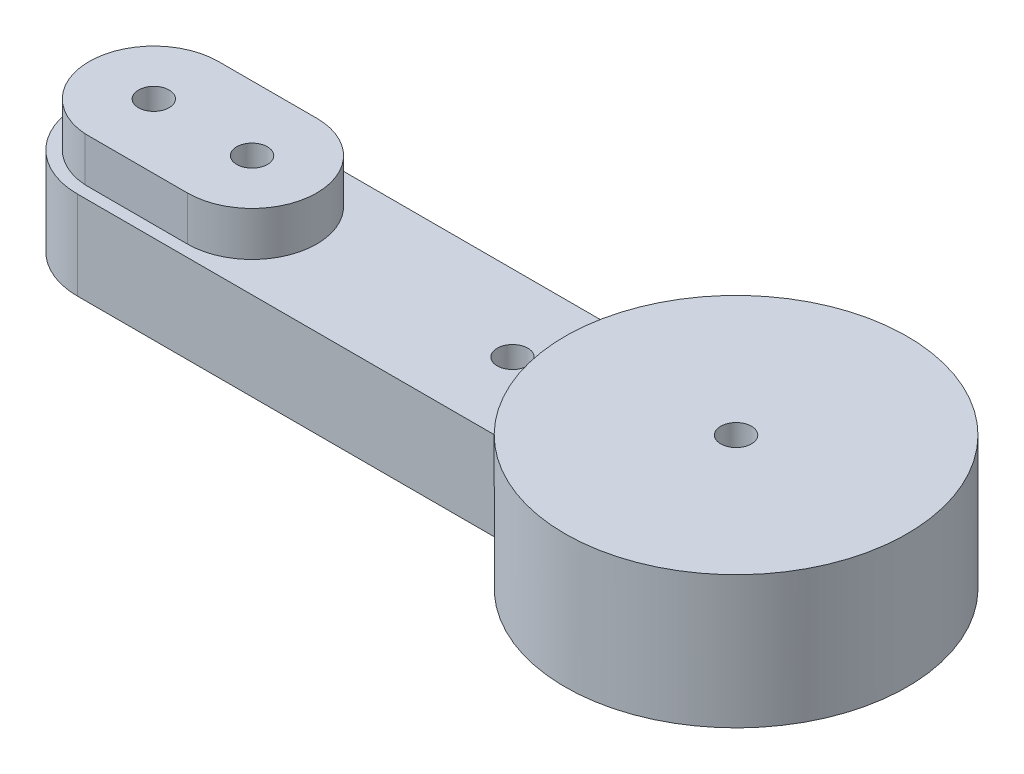
ISO-10303-21;
HEADER;
FILE_DESCRIPTION(('STEP AP214'),'2;1');
FILE_NAME('part.step','',(''),(''),'','','');
FILE_SCHEMA(('AUTOMOTIVE_DESIGN { 1 0 10303 214 1 1 1 1 }'));
ENDSEC;
DATA;
#1=APPLICATION_CONTEXT('core data for automotive mechanical design processes');
#2=APPLICATION_PROTOCOL_DEFINITION('international standard','automotive_design',2000,#1);
#3=PRODUCT_CONTEXT('',#1,'mechanical');
#4=PRODUCT('Part','Part','',(#3));
#5=PRODUCT_RELATED_PRODUCT_CATEGORY('part','',(#4));
#6=PRODUCT_DEFINITION_FORMATION('','',#4);
#7=PRODUCT_DEFINITION_CONTEXT('part definition',#1,'design');
#8=PRODUCT_DEFINITION('design','',#6,#7);
#9=PRODUCT_DEFINITION_SHAPE('','',#8);
#10=(LENGTH_UNIT() NAMED_UNIT(*) SI_UNIT(.MILLI.,.METRE.));
#11=(NAMED_UNIT(*) PLANE_ANGLE_UNIT() SI_UNIT($,.RADIAN.));
#12=(NAMED_UNIT(*) SI_UNIT($,.STERADIAN.) SOLID_ANGLE_UNIT());
#13=UNCERTAINTY_MEASURE_WITH_UNIT(LENGTH_MEASURE(1.E-05),#10,'distance_accuracy_value','');
#14=(GEOMETRIC_REPRESENTATION_CONTEXT(3) GLOBAL_UNCERTAINTY_ASSIGNED_CONTEXT((#13)) GLOBAL_UNIT_ASSIGNED_CONTEXT((#10,
#11,#12)) REPRESENTATION_CONTEXT('',''));
#15=CARTESIAN_POINT('',(0.,0.,0.));
#16=DIRECTION('',(0.,0.,1.));
#17=DIRECTION('',(1.,0.,0.));
#18=AXIS2_PLACEMENT_3D('',#15,#16,#17);
#19=CARTESIAN_POINT('',(-23.7,3.6,0.));
#20=DIRECTION('',(0.,1.,0.));
#21=DIRECTION('',(0.,0.,1.));
#22=AXIS2_PLACEMENT_3D('',#19,#20,#21);
#23=PLANE('',#22);
#24=DIRECTION('',(-0.999999192539096,0.,-0.00127079548162997));
#25=VECTOR('',#24,1.);
#26=CARTESIAN_POINT('',(-0.00337878928647103,3.6,2.6587964838347));
#27=LINE('',#26,#25);
#28=CARTESIAN_POINT('',(-19.7,3.6,2.63376608638568));
#29=VERTEX_POINT('',#28);
#30=CARTESIAN_POINT('',(-23.8669287885352,3.6,2.62847076783317));
#31=VERTEX_POINT('',#30);
#32=EDGE_CURVE('E171',#29,#31,#27,.T.);
#33=ORIENTED_EDGE('',*,*,#32,.T.);
#34=CARTESIAN_POINT('',(-23.7,3.6,0.));
#35=DIRECTION('',(0.,1.,0.));
#36=DIRECTION('',(0.,0.,1.));
#37=AXIS2_PLACEMENT_3D('',#34,#35,#36);
#38=CIRCLE('',#37,2.63376608638568);
#39=CARTESIAN_POINT('',(-23.7,3.6,-2.63376608638568));
#40=VERTEX_POINT('',#39);
#41=EDGE_CURVE('E151',#40,#31,#38,.T.);
#42=ORIENTED_EDGE('',*,*,#41,.F.);
#43=DIRECTION('',(-1.,0.,0.));
#44=VECTOR('',#43,1.);
#45=CARTESIAN_POINT('',(0.,3.6,-2.63376608638568));
#46=LINE('',#45,#44);
#47=CARTESIAN_POINT('',(-19.7,3.6,-2.63376608638568));
#48=VERTEX_POINT('',#47);
#49=EDGE_CURVE('E63',#48,#40,#46,.T.);
#50=ORIENTED_EDGE('',*,*,#49,.F.);
#51=CARTESIAN_POINT('',(-19.7,3.6,0.));
#52=DIRECTION('',(0.,1.,0.));
#53=DIRECTION('',(0.,0.,1.));
#54=AXIS2_PLACEMENT_3D('',#51,#52,#53);
#55=CIRCLE('',#54,2.63376608638568);
#56=EDGE_CURVE('E175',#29,#48,#55,.T.);
#57=ORIENTED_EDGE('',*,*,#56,.F.);
#58=EDGE_LOOP('',(#33,#42,#50,#57));
#59=FACE_BOUND('',#58,.T.);
#60=CARTESIAN_POINT('',(-9.1,3.6,0.));
#61=DIRECTION('',(0.,1.,0.));
#62=DIRECTION('',(0.,0.,1.));
#63=AXIS2_PLACEMENT_3D('',#60,#61,#62);
#64=CIRCLE('',#63,0.625000000000001);
#65=CARTESIAN_POINT('',(-9.1,3.6,0.625000000000002));
#66=VERTEX_POINT('',#65);
#67=EDGE_CURVE('E200',#66,#66,#64,.T.);
#68=ORIENTED_EDGE('',*,*,#67,.F.);
#69=EDGE_LOOP('',(#68));
#70=FACE_BOUND('',#69,.T.);
#71=DIRECTION('',(1.,0.,0.));
#72=VECTOR('',#71,1.);
#73=CARTESIAN_POINT('',(-23.7,3.6,3.10797328550213));
#74=LINE('',#73,#72);
#75=CARTESIAN_POINT('',(-23.7,3.6,3.10797328550213));
#76=VERTEX_POINT('',#75);
#77=CARTESIAN_POINT('',(-6.23006508532201,3.6,3.10797328550213));
#78=VERTEX_POINT('',#77);
#79=EDGE_CURVE('E98',#76,#78,#74,.T.);
#80=ORIENTED_EDGE('',*,*,#79,.T.);
#81=CARTESIAN_POINT('',(0.,3.6,0.));
#82=DIRECTION('',(0.,1.,0.));
#83=DIRECTION('',(0.,0.,1.));
#84=AXIS2_PLACEMENT_3D('',#81,#82,#83);
#85=CIRCLE('',#84,6.96227038477702);
#86=CARTESIAN_POINT('',(-6.23006508532201,3.6,-3.10797328550213));
#87=VERTEX_POINT('',#86);
#88=EDGE_CURVE('E132',#87,#78,#85,.T.);
#89=ORIENTED_EDGE('',*,*,#88,.F.);
#90=DIRECTION('',(-1.,0.,0.));
#91=VECTOR('',#90,1.);
#92=CARTESIAN_POINT('',(-23.7,3.6,-3.10797328550213));
#93=LINE('',#92,#91);
#94=CARTESIAN_POINT('',(-23.7,3.6,-3.10797328550213));
#95=VERTEX_POINT('',#94);
#96=EDGE_CURVE('E72',#87,#95,#93,.T.);
#97=ORIENTED_EDGE('',*,*,#96,.T.);
#98=CARTESIAN_POINT('',(-23.7,3.6,0.));
#99=DIRECTION('',(0.,1.,0.));
#100=DIRECTION('',(0.,0.,1.));
#101=AXIS2_PLACEMENT_3D('',#98,#99,#100);
#102=CIRCLE('',#101,3.10797328550213);
#103=EDGE_CURVE('E216',#95,#76,#102,.T.);
#104=ORIENTED_EDGE('',*,*,#103,.T.);
#105=EDGE_LOOP('',(#80,#89,#97,#104));
#106=FACE_BOUND('',#105,.T.);
#107=ADVANCED_FACE('F47',(#59,#70,#106),#23,.T.);
#108=CARTESIAN_POINT('',(-23.7,0.,0.));
#109=DIRECTION('',(0.,1.,0.));
#110=DIRECTION('',(0.,0.,1.));
#111=AXIS2_PLACEMENT_3D('',#108,#109,#110);
#112=PLANE('',#111);
#113=CARTESIAN_POINT('',(-23.7,0.,0.));
#114=DIRECTION('',(0.,1.,0.));
#115=DIRECTION('',(0.,0.,1.));
#116=AXIS2_PLACEMENT_3D('',#113,#114,#115);
#117=CIRCLE('',#116,3.10797328550213);
#118=CARTESIAN_POINT('',(-23.7,0.,-3.10797328550213));
#119=VERTEX_POINT('',#118);
#120=CARTESIAN_POINT('',(-23.7,0.,3.10797328550213));
#121=VERTEX_POINT('',#120);
#122=EDGE_CURVE('E215',#119,#121,#117,.T.);
#123=ORIENTED_EDGE('',*,*,#122,.F.);
#124=DIRECTION('',(-1.,0.,0.));
#125=VECTOR('',#124,1.);
#126=CARTESIAN_POINT('',(-23.7,0.,-3.10797328550213));
#127=LINE('',#126,#125);
#128=CARTESIAN_POINT('',(-6.23006508532201,0.,-3.10797328550213));
#129=VERTEX_POINT('',#128);
#130=EDGE_CURVE('E93',#129,#119,#127,.T.);
#131=ORIENTED_EDGE('',*,*,#130,.F.);
#132=CARTESIAN_POINT('',(0.,0.,0.));
#133=DIRECTION('',(0.,1.,0.));
#134=DIRECTION('',(0.,0.,1.));
#135=AXIS2_PLACEMENT_3D('',#132,#133,#134);
#136=CIRCLE('',#135,6.96227038477702);
#137=CARTESIAN_POINT('',(-6.23006508532201,0.,3.10797328550213));
#138=VERTEX_POINT('',#137);
#139=EDGE_CURVE('E134',#138,#129,#136,.T.);
#140=ORIENTED_EDGE('',*,*,#139,.F.);
#141=DIRECTION('',(1.,0.,0.));
#142=VECTOR('',#141,1.);
#143=CARTESIAN_POINT('',(-23.7,0.,3.10797328550213));
#144=LINE('',#143,#142);
#145=EDGE_CURVE('E224',#121,#138,#144,.T.);
#146=ORIENTED_EDGE('',*,*,#145,.F.);
#147=EDGE_LOOP('',(#123,#131,#140,#146));
#148=FACE_BOUND('',#147,.T.);
#149=CARTESIAN_POINT('',(-23.7,0.,0.));
#150=DIRECTION('',(0.,1.,0.));
#151=DIRECTION('',(0.,0.,1.));
#152=AXIS2_PLACEMENT_3D('',#149,#150,#151);
#153=CIRCLE('',#152,0.624999999999999);
#154=CARTESIAN_POINT('',(-23.7,0.,0.624999999999999));
#155=VERTEX_POINT('',#154);
#156=EDGE_CURVE('E211',#155,#155,#153,.T.);
#157=ORIENTED_EDGE('',*,*,#156,.T.);
#158=EDGE_LOOP('',(#157));
#159=FACE_BOUND('',#158,.T.);
#160=CARTESIAN_POINT('',(-19.7,0.,0.));
#161=DIRECTION('',(0.,1.,0.));
#162=DIRECTION('',(0.,0.,1.));
#163=AXIS2_PLACEMENT_3D('',#160,#161,#162);
#164=CIRCLE('',#163,0.625000000000002);
#165=CARTESIAN_POINT('',(-19.7,0.,0.625000000000005));
#166=VERTEX_POINT('',#165);
#167=EDGE_CURVE('E204',#166,#166,#164,.T.);
#168=ORIENTED_EDGE('',*,*,#167,.T.);
#169=EDGE_LOOP('',(#168));
#170=FACE_BOUND('',#169,.T.);
#171=CARTESIAN_POINT('',(-9.1,0.,0.));
#172=DIRECTION('',(0.,1.,0.));
#173=DIRECTION('',(0.,0.,1.));
#174=AXIS2_PLACEMENT_3D('',#171,#172,#173);
#175=CIRCLE('',#174,0.625000000000001);
#176=CARTESIAN_POINT('',(-9.1,0.,0.625000000000002));
#177=VERTEX_POINT('',#176);
#178=EDGE_CURVE('E199',#177,#177,#175,.T.);
#179=ORIENTED_EDGE('',*,*,#178,.T.);
#180=EDGE_LOOP('',(#179));
#181=FACE_BOUND('',#180,.T.);
#182=CARTESIAN_POINT('',(0.,0.,0.));
#183=DIRECTION('',(0.,1.,0.));
#184=DIRECTION('',(0.,0.,1.));
#185=AXIS2_PLACEMENT_3D('',#182,#183,#184);
#186=CIRCLE('',#185,0.625);
#187=CARTESIAN_POINT('',(0.,0.,0.625));
#188=VERTEX_POINT('',#187);
#189=EDGE_CURVE('E195',#188,#188,#186,.T.);
#190=ORIENTED_EDGE('',*,*,#189,.T.);
#191=EDGE_LOOP('',(#190));
#192=FACE_BOUND('',#191,.T.);
#193=ADVANCED_FACE('F235',(#148,#159,#170,#181,#192),#112,.F.);
#194=CARTESIAN_POINT('',(-23.7,3.6,0.));
#195=DIRECTION('',(0.,-1.,0.));
#196=DIRECTION('',(0.,0.,-1.));
#197=AXIS2_PLACEMENT_3D('',#194,#195,#196);
#198=CYLINDRICAL_SURFACE('',#197,3.10797328550213);
#199=ORIENTED_EDGE('',*,*,#122,.T.);
#200=DIRECTION('',(0.,-1.,0.));
#201=VECTOR('',#200,1.);
#202=CARTESIAN_POINT('',(-23.7,3.6,3.10797328550213));
#203=LINE('',#202,#201);
#204=EDGE_CURVE('E11',#76,#121,#203,.T.);
#205=ORIENTED_EDGE('',*,*,#204,.F.);
#206=ORIENTED_EDGE('',*,*,#103,.F.);
#207=DIRECTION('',(0.,-1.,0.));
#208=VECTOR('',#207,1.);
#209=CARTESIAN_POINT('',(-23.7,3.6,-3.10797328550213));
#210=LINE('',#209,#208);
#211=EDGE_CURVE('E123',#95,#119,#210,.T.);
#212=ORIENTED_EDGE('',*,*,#211,.T.);
#213=EDGE_LOOP('',(#199,#205,#206,#212));
#214=FACE_BOUND('',#213,.T.);
#215=ADVANCED_FACE('F49',(#214),#198,.T.);
#216=CARTESIAN_POINT('',(-23.7,3.6,3.10797328550213));
#217=DIRECTION('',(0.,0.,-1.));
#218=DIRECTION('',(-1.,0.,0.));
#219=AXIS2_PLACEMENT_3D('',#216,#217,#218);
#220=PLANE('',#219);
#221=ORIENTED_EDGE('',*,*,#145,.T.);
#222=DIRECTION('',(0.,-1.,0.));
#223=VECTOR('',#222,1.);
#224=CARTESIAN_POINT('',(-6.23006508532201,3.6,3.10797328550213));
#225=LINE('',#224,#223);
#226=EDGE_CURVE('E56',#78,#138,#225,.T.);
#227=ORIENTED_EDGE('',*,*,#226,.F.);
#228=ORIENTED_EDGE('',*,*,#79,.F.);
#229=ORIENTED_EDGE('',*,*,#204,.T.);
#230=EDGE_LOOP('',(#221,#227,#228,#229));
#231=FACE_BOUND('',#230,.T.);
#232=ADVANCED_FACE('F239',(#231),#220,.F.);
#233=CARTESIAN_POINT('',(0.,3.6,0.));
#234=DIRECTION('',(0.,-1.,0.));
#235=DIRECTION('',(0.,0.,-1.));
#236=AXIS2_PLACEMENT_3D('',#233,#234,#235);
#237=CYLINDRICAL_SURFACE('',#236,6.96227038477702);
#238=ORIENTED_EDGE('',*,*,#139,.T.);
#239=DIRECTION('',(0.,-1.,0.));
#240=VECTOR('',#239,1.);
#241=CARTESIAN_POINT('',(-6.23006508532201,3.6,-3.10797328550213));
#242=LINE('',#241,#240);
#243=EDGE_CURVE('E122',#87,#129,#242,.T.);
#244=ORIENTED_EDGE('',*,*,#243,.F.);
#245=ORIENTED_EDGE('',*,*,#88,.T.);
#246=ORIENTED_EDGE('',*,*,#226,.T.);
#247=EDGE_LOOP('',(#238,#244,#245,#246));
#248=FACE_BOUND('',#247,.T.);
#249=CARTESIAN_POINT('',(0.,5.4,0.));
#250=DIRECTION('',(0.,1.,0.));
#251=DIRECTION('',(0.,0.,1.));
#252=AXIS2_PLACEMENT_3D('',#249,#250,#251);
#253=CIRCLE('',#252,6.96227038477702);
#254=CARTESIAN_POINT('',(0.,5.4,6.96227038477702));
#255=VERTEX_POINT('',#254);
#256=EDGE_CURVE('E142',#255,#255,#253,.T.);
#257=ORIENTED_EDGE('',*,*,#256,.F.);
#258=EDGE_LOOP('',(#257));
#259=FACE_BOUND('',#258,.T.);
#260=ADVANCED_FACE('F129',(#248,#259),#237,.T.);
#261=CARTESIAN_POINT('',(-23.7,3.6,-3.10797328550213));
#262=DIRECTION('',(0.,0.,1.));
#263=DIRECTION('',(1.,0.,0.));
#264=AXIS2_PLACEMENT_3D('',#261,#262,#263);
#265=PLANE('',#264);
#266=ORIENTED_EDGE('',*,*,#130,.T.);
#267=ORIENTED_EDGE('',*,*,#211,.F.);
#268=ORIENTED_EDGE('',*,*,#96,.F.);
#269=ORIENTED_EDGE('',*,*,#243,.T.);
#270=EDGE_LOOP('',(#266,#267,#268,#269));
#271=FACE_BOUND('',#270,.T.);
#272=ADVANCED_FACE('F121',(#271),#265,.F.);
#273=CARTESIAN_POINT('',(-23.7,3.6,0.));
#274=DIRECTION('',(0.,-1.,0.));
#275=DIRECTION('',(0.,0.,-1.));
#276=AXIS2_PLACEMENT_3D('',#273,#274,#275);
#277=CYLINDRICAL_SURFACE('',#276,0.624999999999999);
#278=ORIENTED_EDGE('',*,*,#156,.F.);
#279=EDGE_LOOP('',(#278));
#280=FACE_BOUND('',#279,.T.);
#281=CARTESIAN_POINT('',(-23.7,5.4,0.));
#282=DIRECTION('',(0.,1.,0.));
#283=DIRECTION('',(0.,0.,1.));
#284=AXIS2_PLACEMENT_3D('',#281,#282,#283);
#285=CIRCLE('',#284,0.624999999999999);
#286=CARTESIAN_POINT('',(-23.7,5.4,0.624999999999999));
#287=VERTEX_POINT('',#286);
#288=EDGE_CURVE('E150',#287,#287,#285,.F.);
#289=ORIENTED_EDGE('',*,*,#288,.F.);
#290=EDGE_LOOP('',(#289));
#291=FACE_BOUND('',#290,.T.);
#292=ADVANCED_FACE('F256',(#280,#291),#277,.F.);
#293=CARTESIAN_POINT('',(-19.7,3.6,0.));
#294=DIRECTION('',(0.,-1.,0.));
#295=DIRECTION('',(0.,0.,-1.));
#296=AXIS2_PLACEMENT_3D('',#293,#294,#295);
#297=CYLINDRICAL_SURFACE('',#296,0.625000000000002);
#298=ORIENTED_EDGE('',*,*,#167,.F.);
#299=EDGE_LOOP('',(#298));
#300=FACE_BOUND('',#299,.T.);
#301=CARTESIAN_POINT('',(-19.7,5.4,0.));
#302=DIRECTION('',(0.,1.,0.));
#303=DIRECTION('',(0.,0.,1.));
#304=AXIS2_PLACEMENT_3D('',#301,#302,#303);
#305=CIRCLE('',#304,0.625000000000002);
#306=CARTESIAN_POINT('',(-19.7,5.4,0.625000000000005));
#307=VERTEX_POINT('',#306);
#308=EDGE_CURVE('E146',#307,#307,#305,.F.);
#309=ORIENTED_EDGE('',*,*,#308,.F.);
#310=EDGE_LOOP('',(#309));
#311=FACE_BOUND('',#310,.T.);
#312=ADVANCED_FACE('F263',(#300,#311),#297,.F.);
#313=CARTESIAN_POINT('',(-9.1,3.6,0.));
#314=DIRECTION('',(0.,-1.,0.));
#315=DIRECTION('',(0.,0.,-1.));
#316=AXIS2_PLACEMENT_3D('',#313,#314,#315);
#317=CYLINDRICAL_SURFACE('',#316,0.625000000000001);
#318=ORIENTED_EDGE('',*,*,#67,.T.);
#319=EDGE_LOOP('',(#318));
#320=FACE_BOUND('',#319,.T.);
#321=ORIENTED_EDGE('',*,*,#178,.F.);
#322=EDGE_LOOP('',(#321));
#323=FACE_BOUND('',#322,.T.);
#324=ADVANCED_FACE('F268',(#320,#323),#317,.F.);
#325=CARTESIAN_POINT('',(0.,3.6,0.));
#326=DIRECTION('',(0.,-1.,0.));
#327=DIRECTION('',(0.,0.,-1.));
#328=AXIS2_PLACEMENT_3D('',#325,#326,#327);
#329=CYLINDRICAL_SURFACE('',#328,0.625);
#330=ORIENTED_EDGE('',*,*,#189,.F.);
#331=EDGE_LOOP('',(#330));
#332=FACE_BOUND('',#331,.T.);
#333=CARTESIAN_POINT('',(0.,5.4,0.));
#334=DIRECTION('',(0.,1.,0.));
#335=DIRECTION('',(0.,0.,1.));
#336=AXIS2_PLACEMENT_3D('',#333,#334,#335);
#337=CIRCLE('',#336,0.625);
#338=CARTESIAN_POINT('',(0.,5.4,0.625));
#339=VERTEX_POINT('',#338);
#340=EDGE_CURVE('E138',#339,#339,#337,.F.);
#341=ORIENTED_EDGE('',*,*,#340,.F.);
#342=EDGE_LOOP('',(#341));
#343=FACE_BOUND('',#342,.T.);
#344=ADVANCED_FACE('F306',(#332,#343),#329,.F.);
#345=CARTESIAN_POINT('',(-0.00337878928647103,5.4,2.6587964838347));
#346=DIRECTION('',(-0.00127079548162997,0.,0.999999192539096));
#347=DIRECTION('',(0.999999192539096,0.,0.00127079548162997));
#348=AXIS2_PLACEMENT_3D('',#345,#346,#347);
#349=PLANE('',#348);
#350=ORIENTED_EDGE('',*,*,#32,.F.);
#351=DIRECTION('',(0.,-1.,0.));
#352=VECTOR('',#351,1.);
#353=CARTESIAN_POINT('',(-19.7,5.4,2.63376608638568));
#354=LINE('',#353,#352);
#355=CARTESIAN_POINT('',(-19.7,5.4,2.63376608638568));
#356=VERTEX_POINT('',#355);
#357=EDGE_CURVE('E192',#356,#29,#354,.T.);
#358=ORIENTED_EDGE('',*,*,#357,.F.);
#359=DIRECTION('',(-0.999999192539096,0.,-0.00127079548162997));
#360=VECTOR('',#359,1.);
#361=CARTESIAN_POINT('',(-0.00337878928647103,5.4,2.6587964838347));
#362=LINE('',#361,#360);
#363=CARTESIAN_POINT('',(-23.8669287885352,5.4,2.62847076783317));
#364=VERTEX_POINT('',#363);
#365=EDGE_CURVE('E155',#356,#364,#362,.T.);
#366=ORIENTED_EDGE('',*,*,#365,.T.);
#367=DIRECTION('',(0.,-1.,0.));
#368=VECTOR('',#367,1.);
#369=CARTESIAN_POINT('',(-23.8669287885352,5.4,2.62847076783317));
#370=LINE('',#369,#368);
#371=EDGE_CURVE('E170',#364,#31,#370,.T.);
#372=ORIENTED_EDGE('',*,*,#371,.T.);
#373=EDGE_LOOP('',(#350,#358,#366,#372));
#374=FACE_BOUND('',#373,.T.);
#375=ADVANCED_FACE('F287',(#374),#349,.T.);
#376=CARTESIAN_POINT('',(-19.7,5.4,0.));
#377=DIRECTION('',(0.,-1.,0.));
#378=DIRECTION('',(0.,0.,-1.));
#379=AXIS2_PLACEMENT_3D('',#376,#377,#378);
#380=CYLINDRICAL_SURFACE('',#379,2.63376608638568);
#381=ORIENTED_EDGE('',*,*,#56,.T.);
#382=DIRECTION('',(0.,-1.,0.));
#383=VECTOR('',#382,1.);
#384=CARTESIAN_POINT('',(-19.7,5.4,-2.63376608638568));
#385=LINE('',#384,#383);
#386=CARTESIAN_POINT('',(-19.7,5.4,-2.63376608638568));
#387=VERTEX_POINT('',#386);
#388=EDGE_CURVE('E189',#387,#48,#385,.T.);
#389=ORIENTED_EDGE('',*,*,#388,.F.);
#390=CARTESIAN_POINT('',(-19.7,5.4,0.));
#391=DIRECTION('',(0.,1.,0.));
#392=DIRECTION('',(0.,0.,1.));
#393=AXIS2_PLACEMENT_3D('',#390,#391,#392);
#394=CIRCLE('',#393,2.63376608638568);
#395=EDGE_CURVE('E159',#356,#387,#394,.T.);
#396=ORIENTED_EDGE('',*,*,#395,.F.);
#397=ORIENTED_EDGE('',*,*,#357,.T.);
#398=EDGE_LOOP('',(#381,#389,#396,#397));
#399=FACE_BOUND('',#398,.T.);
#400=ADVANCED_FACE('F290',(#399),#380,.T.);
#401=CARTESIAN_POINT('',(0.,5.4,-2.63376608638568));
#402=DIRECTION('',(0.,0.,1.));
#403=DIRECTION('',(1.,0.,0.));
#404=AXIS2_PLACEMENT_3D('',#401,#402,#403);
#405=PLANE('',#404);
#406=ORIENTED_EDGE('',*,*,#49,.T.);
#407=DIRECTION('',(0.,-1.,0.));
#408=VECTOR('',#407,1.);
#409=CARTESIAN_POINT('',(-23.7,5.4,-2.63376608638568));
#410=LINE('',#409,#408);
#411=CARTESIAN_POINT('',(-23.7,5.4,-2.63376608638568));
#412=VERTEX_POINT('',#411);
#413=EDGE_CURVE('E186',#412,#40,#410,.T.);
#414=ORIENTED_EDGE('',*,*,#413,.F.);
#415=DIRECTION('',(-1.,0.,0.));
#416=VECTOR('',#415,1.);
#417=CARTESIAN_POINT('',(0.,5.4,-2.63376608638568));
#418=LINE('',#417,#416);
#419=EDGE_CURVE('E163',#387,#412,#418,.T.);
#420=ORIENTED_EDGE('',*,*,#419,.F.);
#421=ORIENTED_EDGE('',*,*,#388,.T.);
#422=EDGE_LOOP('',(#406,#414,#420,#421));
#423=FACE_BOUND('',#422,.T.);
#424=ADVANCED_FACE('F291',(#423),#405,.F.);
#425=CARTESIAN_POINT('',(-23.7,5.4,0.));
#426=DIRECTION('',(0.,-1.,0.));
#427=DIRECTION('',(0.,0.,-1.));
#428=AXIS2_PLACEMENT_3D('',#425,#426,#427);
#429=CYLINDRICAL_SURFACE('',#428,2.63376608638568);
#430=ORIENTED_EDGE('',*,*,#41,.T.);
#431=ORIENTED_EDGE('',*,*,#371,.F.);
#432=CARTESIAN_POINT('',(-23.7,5.4,0.));
#433=DIRECTION('',(0.,1.,0.));
#434=DIRECTION('',(0.,0.,1.));
#435=AXIS2_PLACEMENT_3D('',#432,#433,#434);
#436=CIRCLE('',#435,2.63376608638568);
#437=EDGE_CURVE('E167',#412,#364,#436,.T.);
#438=ORIENTED_EDGE('',*,*,#437,.F.);
#439=ORIENTED_EDGE('',*,*,#413,.T.);
#440=EDGE_LOOP('',(#430,#431,#438,#439));
#441=FACE_BOUND('',#440,.T.);
#442=ADVANCED_FACE('F278',(#441),#429,.T.);
#443=CARTESIAN_POINT('',(0.,5.4,0.));
#444=DIRECTION('',(0.,1.,0.));
#445=DIRECTION('',(0.,0.,1.));
#446=AXIS2_PLACEMENT_3D('',#443,#444,#445);
#447=PLANE('',#446);
#448=ORIENTED_EDGE('',*,*,#308,.T.);
#449=EDGE_LOOP('',(#448));
#450=FACE_BOUND('',#449,.T.);
#451=ORIENTED_EDGE('',*,*,#288,.T.);
#452=EDGE_LOOP('',(#451));
#453=FACE_BOUND('',#452,.T.);
#454=ORIENTED_EDGE('',*,*,#365,.F.);
#455=ORIENTED_EDGE('',*,*,#395,.T.);
#456=ORIENTED_EDGE('',*,*,#419,.T.);
#457=ORIENTED_EDGE('',*,*,#437,.T.);
#458=EDGE_LOOP('',(#454,#455,#456,#457));
#459=FACE_BOUND('',#458,.T.);
#460=ADVANCED_FACE('F274',(#450,#453,#459),#447,.T.);
#461=CARTESIAN_POINT('',(0.,5.4,0.));
#462=DIRECTION('',(0.,1.,0.));
#463=DIRECTION('',(0.,0.,1.));
#464=AXIS2_PLACEMENT_3D('',#461,#462,#463);
#465=PLANE('',#464);
#466=ORIENTED_EDGE('',*,*,#340,.T.);
#467=EDGE_LOOP('',(#466));
#468=FACE_BOUND('',#467,.T.);
#469=ORIENTED_EDGE('',*,*,#256,.T.);
#470=EDGE_LOOP('',(#469));
#471=FACE_BOUND('',#470,.T.);
#472=ADVANCED_FACE('F277',(#468,#471),#465,.T.);
#473=CLOSED_SHELL('',(#107,#193,#215,#232,#260,#272,#292,#312,#324,#344,#375,#400,#424,#442,
#460,#472));
#474=MANIFOLD_SOLID_BREP('B2',#473);
#475=ADVANCED_BREP_SHAPE_REPRESENTATION('',(#18,#474),#14);
#476=SHAPE_DEFINITION_REPRESENTATION(#9,#475);
ENDSEC;
END-ISO-10303-21;
